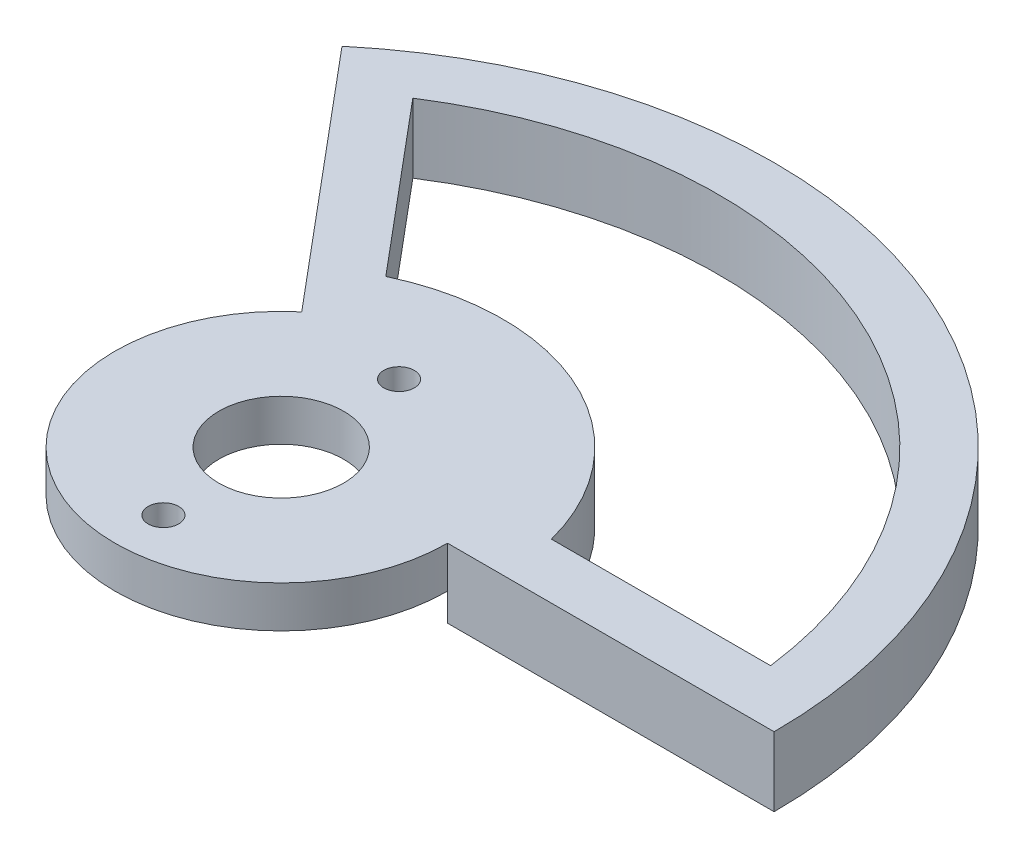
ISO-10303-21;
HEADER;
FILE_DESCRIPTION(('STEP AP214'),'2;1');
FILE_NAME('part.step','',(''),(''),'','','');
FILE_SCHEMA(('AUTOMOTIVE_DESIGN { 1 0 10303 214 1 1 1 1 }'));
ENDSEC;
DATA;
#1=APPLICATION_CONTEXT('core data for automotive mechanical design processes');
#2=APPLICATION_PROTOCOL_DEFINITION('international standard','automotive_design',2000,#1);
#3=PRODUCT_CONTEXT('',#1,'mechanical');
#4=PRODUCT('Part','Part','',(#3));
#5=PRODUCT_RELATED_PRODUCT_CATEGORY('part','',(#4));
#6=PRODUCT_DEFINITION_FORMATION('','',#4);
#7=PRODUCT_DEFINITION_CONTEXT('part definition',#1,'design');
#8=PRODUCT_DEFINITION('design','',#6,#7);
#9=PRODUCT_DEFINITION_SHAPE('','',#8);
#10=(LENGTH_UNIT() NAMED_UNIT(*) SI_UNIT(.MILLI.,.METRE.));
#11=(NAMED_UNIT(*) PLANE_ANGLE_UNIT() SI_UNIT($,.RADIAN.));
#12=(NAMED_UNIT(*) SI_UNIT($,.STERADIAN.) SOLID_ANGLE_UNIT());
#13=UNCERTAINTY_MEASURE_WITH_UNIT(LENGTH_MEASURE(1.E-05),#10,'distance_accuracy_value','');
#14=(GEOMETRIC_REPRESENTATION_CONTEXT(3) GLOBAL_UNCERTAINTY_ASSIGNED_CONTEXT((#13)) GLOBAL_UNIT_ASSIGNED_CONTEXT((#10,
#11,#12)) REPRESENTATION_CONTEXT('',''));
#15=CARTESIAN_POINT('',(0.,0.,0.));
#16=DIRECTION('',(0.,0.,1.));
#17=DIRECTION('',(1.,0.,0.));
#18=AXIS2_PLACEMENT_3D('',#15,#16,#17);
#19=CARTESIAN_POINT('',(0.,3.,0.));
#20=DIRECTION('',(0.,1.,0.));
#21=DIRECTION('',(0.,0.,1.));
#22=AXIS2_PLACEMENT_3D('',#19,#20,#21);
#23=PLANE('',#22);
#24=CARTESIAN_POINT('',(0.,3.,0.));
#25=DIRECTION('',(0.,-1.,0.));
#26=DIRECTION('',(0.,0.,-1.));
#27=AXIS2_PLACEMENT_3D('',#24,#25,#26);
#28=CIRCLE('',#27,31.56);
#29=CARTESIAN_POINT('',(-17.0586022455489,3.,-26.5525458182102));
#30=VERTEX_POINT('',#29);
#31=CARTESIAN_POINT('',(31.3054883367118,3.,-4.));
#32=VERTEX_POINT('',#31);
#33=EDGE_CURVE('E106',#30,#32,#28,.T.);
#34=ORIENTED_EDGE('',*,*,#33,.T.);
#35=DIRECTION('',(-1.,0.,0.));
#36=VECTOR('',#35,1.);
#37=CARTESIAN_POINT('',(31.3054883367118,3.,-4.));
#38=LINE('',#37,#36);
#39=CARTESIAN_POINT('',(15.4919333848297,3.,-4.));
#40=VERTEX_POINT('',#39);
#41=EDGE_CURVE('E115',#32,#40,#38,.T.);
#42=ORIENTED_EDGE('',*,*,#41,.T.);
#43=CARTESIAN_POINT('',(0.,3.,0.));
#44=DIRECTION('',(0.,1.,0.));
#45=DIRECTION('',(0.,0.,-1.));
#46=AXIS2_PLACEMENT_3D('',#43,#44,#45);
#47=CIRCLE('',#46,16.);
#48=CARTESIAN_POINT('',(-6.89384505738183,3.,-14.4386599213643));
#49=VERTEX_POINT('',#48);
#50=EDGE_CURVE('E48',#40,#49,#47,.T.);
#51=ORIENTED_EDGE('',*,*,#50,.T.);
#52=DIRECTION('',(-0.642787609686538,0.,-0.766044443118979));
#53=VECTOR('',#52,1.);
#54=CARTESIAN_POINT('',(-6.89384505738183,3.,-14.4386599213643));
#55=LINE('',#54,#53);
#56=EDGE_CURVE('E112',#49,#30,#55,.T.);
#57=ORIENTED_EDGE('',*,*,#56,.T.);
#58=EDGE_LOOP('',(#34,#42,#51,#57));
#59=FACE_BOUND('',#58,.T.);
#60=CARTESIAN_POINT('',(0.,3.,-8.5));
#61=DIRECTION('',(0.,1.,0.));
#62=DIRECTION('',(0.,0.,1.));
#63=AXIS2_PLACEMENT_3D('',#60,#61,#62);
#64=CIRCLE('',#63,1.1);
#65=CARTESIAN_POINT('',(0.,3.,-7.4));
#66=VERTEX_POINT('',#65);
#67=EDGE_CURVE('E176',#66,#66,#64,.T.);
#68=ORIENTED_EDGE('',*,*,#67,.F.);
#69=EDGE_LOOP('',(#68));
#70=FACE_BOUND('',#69,.T.);
#71=CARTESIAN_POINT('',(0.,3.,0.));
#72=DIRECTION('',(0.,1.,0.));
#73=DIRECTION('',(0.,0.,1.));
#74=AXIS2_PLACEMENT_3D('',#71,#72,#73);
#75=CIRCLE('',#74,12.);
#76=CARTESIAN_POINT('',(-7.71345131623846,3.,-9.19253331742775));
#77=VERTEX_POINT('',#76);
#78=CARTESIAN_POINT('',(12.,3.,0.));
#79=VERTEX_POINT('',#78);
#80=EDGE_CURVE('E188',#77,#79,#75,.T.);
#81=ORIENTED_EDGE('',*,*,#80,.T.);
#82=DIRECTION('',(1.,0.,0.));
#83=VECTOR('',#82,1.);
#84=CARTESIAN_POINT('',(12.,3.,0.));
#85=LINE('',#84,#83);
#86=CARTESIAN_POINT('',(35.56,3.,0.));
#87=VERTEX_POINT('',#86);
#88=EDGE_CURVE('E144',#79,#87,#85,.T.);
#89=ORIENTED_EDGE('',*,*,#88,.T.);
#90=CARTESIAN_POINT('',(0.,3.,0.));
#91=DIRECTION('',(0.,1.,0.));
#92=DIRECTION('',(0.,0.,1.));
#93=AXIS2_PLACEMENT_3D('',#90,#91,#92);
#94=CIRCLE('',#93,35.56);
#95=CARTESIAN_POINT('',(-22.8575274004533,3.,-27.2405403973109));
#96=VERTEX_POINT('',#95);
#97=EDGE_CURVE('E136',#87,#96,#94,.T.);
#98=ORIENTED_EDGE('',*,*,#97,.T.);
#99=DIRECTION('',(0.642787609686538,0.,0.766044443118979));
#100=VECTOR('',#99,1.);
#101=CARTESIAN_POINT('',(-22.8575274004533,3.,-27.2405403973109));
#102=LINE('',#101,#100);
#103=EDGE_CURVE('E156',#96,#77,#102,.T.);
#104=ORIENTED_EDGE('',*,*,#103,.T.);
#105=EDGE_LOOP('',(#81,#89,#98,#104));
#106=FACE_BOUND('',#105,.T.);
#107=CARTESIAN_POINT('',(0.,3.,0.));
#108=DIRECTION('',(0.,1.,0.));
#109=DIRECTION('',(0.,0.,1.));
#110=AXIS2_PLACEMENT_3D('',#107,#108,#109);
#111=CIRCLE('',#110,4.5);
#112=CARTESIAN_POINT('',(0.,3.,4.5));
#113=VERTEX_POINT('',#112);
#114=EDGE_CURVE('E182',#113,#113,#111,.T.);
#115=ORIENTED_EDGE('',*,*,#114,.F.);
#116=EDGE_LOOP('',(#115));
#117=FACE_BOUND('',#116,.T.);
#118=CARTESIAN_POINT('',(0.,3.,8.5));
#119=DIRECTION('',(0.,1.,0.));
#120=DIRECTION('',(0.,0.,1.));
#121=AXIS2_PLACEMENT_3D('',#118,#119,#120);
#122=CIRCLE('',#121,1.1);
#123=CARTESIAN_POINT('',(0.,3.,9.6));
#124=VERTEX_POINT('',#123);
#125=EDGE_CURVE('E170',#124,#124,#122,.T.);
#126=ORIENTED_EDGE('',*,*,#125,.F.);
#127=EDGE_LOOP('',(#126));
#128=FACE_BOUND('',#127,.T.);
#129=ADVANCED_FACE('F33',(#59,#70,#106,#117,#128),#23,.T.);
#130=CARTESIAN_POINT('',(0.,0.,0.));
#131=DIRECTION('',(0.,1.,0.));
#132=DIRECTION('',(0.,0.,1.));
#133=AXIS2_PLACEMENT_3D('',#130,#131,#132);
#134=PLANE('',#133);
#135=CARTESIAN_POINT('',(0.,0.,0.));
#136=DIRECTION('',(0.,1.,0.));
#137=DIRECTION('',(0.,0.,1.));
#138=AXIS2_PLACEMENT_3D('',#135,#136,#137);
#139=CIRCLE('',#138,12.);
#140=CARTESIAN_POINT('',(12.,0.,0.));
#141=VERTEX_POINT('',#140);
#142=CARTESIAN_POINT('',(-7.71345131623846,0.,-9.19253331742775));
#143=VERTEX_POINT('',#142);
#144=EDGE_CURVE('E191',#141,#143,#139,.T.);
#145=ORIENTED_EDGE('',*,*,#144,.F.);
#146=EDGE_CURVE('E185',#143,#141,#139,.T.);
#147=ORIENTED_EDGE('',*,*,#146,.F.);
#148=EDGE_LOOP('',(#145,#147));
#149=FACE_BOUND('',#148,.T.);
#150=CARTESIAN_POINT('',(0.,0.,0.));
#151=DIRECTION('',(0.,1.,0.));
#152=DIRECTION('',(0.,0.,1.));
#153=AXIS2_PLACEMENT_3D('',#150,#151,#152);
#154=CIRCLE('',#153,4.5);
#155=CARTESIAN_POINT('',(0.,0.,4.5));
#156=VERTEX_POINT('',#155);
#157=EDGE_CURVE('E179',#156,#156,#154,.T.);
#158=ORIENTED_EDGE('',*,*,#157,.T.);
#159=EDGE_LOOP('',(#158));
#160=FACE_BOUND('',#159,.T.);
#161=CARTESIAN_POINT('',(0.,0.,-8.5));
#162=DIRECTION('',(0.,1.,0.));
#163=DIRECTION('',(0.,0.,1.));
#164=AXIS2_PLACEMENT_3D('',#161,#162,#163);
#165=CIRCLE('',#164,1.1);
#166=CARTESIAN_POINT('',(0.,0.,-7.4));
#167=VERTEX_POINT('',#166);
#168=EDGE_CURVE('E173',#167,#167,#165,.T.);
#169=ORIENTED_EDGE('',*,*,#168,.T.);
#170=EDGE_LOOP('',(#169));
#171=FACE_BOUND('',#170,.T.);
#172=CARTESIAN_POINT('',(0.,0.,8.5));
#173=DIRECTION('',(0.,1.,0.));
#174=DIRECTION('',(0.,0.,1.));
#175=AXIS2_PLACEMENT_3D('',#172,#173,#174);
#176=CIRCLE('',#175,1.1);
#177=CARTESIAN_POINT('',(0.,0.,9.6));
#178=VERTEX_POINT('',#177);
#179=EDGE_CURVE('E162',#178,#178,#176,.T.);
#180=ORIENTED_EDGE('',*,*,#179,.T.);
#181=EDGE_LOOP('',(#180));
#182=FACE_BOUND('',#181,.T.);
#183=ADVANCED_FACE('F202',(#149,#160,#171,#182),#134,.F.);
#184=CARTESIAN_POINT('',(0.,3.,0.));
#185=DIRECTION('',(0.,-1.,0.));
#186=DIRECTION('',(0.,0.,-1.));
#187=AXIS2_PLACEMENT_3D('',#184,#185,#186);
#188=CYLINDRICAL_SURFACE('',#187,12.);
#189=ORIENTED_EDGE('',*,*,#146,.T.);
#190=DIRECTION('',(0.,-1.,0.));
#191=VECTOR('',#190,1.);
#192=CARTESIAN_POINT('',(12.,3.,0.));
#193=LINE('',#192,#191);
#194=EDGE_CURVE('E11',#141,#79,#193,.F.);
#195=ORIENTED_EDGE('',*,*,#194,.T.);
#196=ORIENTED_EDGE('',*,*,#80,.F.);
#197=DIRECTION('',(0.,-1.,0.));
#198=VECTOR('',#197,1.);
#199=CARTESIAN_POINT('',(-7.71345131623846,3.,-9.19253331742775));
#200=LINE('',#199,#198);
#201=EDGE_CURVE('E41',#77,#143,#200,.T.);
#202=ORIENTED_EDGE('',*,*,#201,.T.);
#203=EDGE_LOOP('',(#189,#195,#196,#202));
#204=FACE_BOUND('',#203,.T.);
#205=ADVANCED_FACE('F35',(#204),#188,.T.);
#206=CARTESIAN_POINT('',(0.,3.,0.));
#207=DIRECTION('',(0.,-1.,0.));
#208=DIRECTION('',(0.,0.,-1.));
#209=AXIS2_PLACEMENT_3D('',#206,#207,#208);
#210=CYLINDRICAL_SURFACE('',#209,4.5);
#211=ORIENTED_EDGE('',*,*,#114,.T.);
#212=EDGE_LOOP('',(#211));
#213=FACE_BOUND('',#212,.T.);
#214=ORIENTED_EDGE('',*,*,#157,.F.);
#215=EDGE_LOOP('',(#214));
#216=FACE_BOUND('',#215,.T.);
#217=ADVANCED_FACE('F237',(#213,#216),#210,.F.);
#218=CARTESIAN_POINT('',(0.,3.,-8.5));
#219=DIRECTION('',(0.,-1.,0.));
#220=DIRECTION('',(0.,0.,-1.));
#221=AXIS2_PLACEMENT_3D('',#218,#219,#220);
#222=CYLINDRICAL_SURFACE('',#221,1.1);
#223=ORIENTED_EDGE('',*,*,#67,.T.);
#224=EDGE_LOOP('',(#223));
#225=FACE_BOUND('',#224,.T.);
#226=ORIENTED_EDGE('',*,*,#168,.F.);
#227=EDGE_LOOP('',(#226));
#228=FACE_BOUND('',#227,.T.);
#229=ADVANCED_FACE('F229',(#225,#228),#222,.F.);
#230=CARTESIAN_POINT('',(0.,3.,8.5));
#231=DIRECTION('',(0.,-1.,0.));
#232=DIRECTION('',(0.,0.,-1.));
#233=AXIS2_PLACEMENT_3D('',#230,#231,#232);
#234=CYLINDRICAL_SURFACE('',#233,1.1);
#235=ORIENTED_EDGE('',*,*,#125,.T.);
#236=EDGE_LOOP('',(#235));
#237=FACE_BOUND('',#236,.T.);
#238=ORIENTED_EDGE('',*,*,#179,.F.);
#239=EDGE_LOOP('',(#238));
#240=FACE_BOUND('',#239,.T.);
#241=ADVANCED_FACE('F226',(#237,#240),#234,.F.);
#242=CARTESIAN_POINT('',(0.,-2.,0.));
#243=DIRECTION('',(0.,1.,0.));
#244=DIRECTION('',(0.,0.,1.));
#245=AXIS2_PLACEMENT_3D('',#242,#243,#244);
#246=CYLINDRICAL_SURFACE('',#245,12.);
#247=ORIENTED_EDGE('',*,*,#144,.T.);
#248=DIRECTION('',(0.,1.,0.));
#249=VECTOR('',#248,1.);
#250=CARTESIAN_POINT('',(-7.71345131623846,-2.,-9.19253331742775));
#251=LINE('',#250,#249);
#252=CARTESIAN_POINT('',(-7.71345131623846,-2.,-9.19253331742775));
#253=VERTEX_POINT('',#252);
#254=EDGE_CURVE('E166',#253,#143,#251,.T.);
#255=ORIENTED_EDGE('',*,*,#254,.F.);
#256=CARTESIAN_POINT('',(0.,-2.,0.));
#257=DIRECTION('',(0.,-1.,0.));
#258=DIRECTION('',(0.,0.,1.));
#259=AXIS2_PLACEMENT_3D('',#256,#257,#258);
#260=CIRCLE('',#259,12.);
#261=CARTESIAN_POINT('',(12.,-2.,0.));
#262=VERTEX_POINT('',#261);
#263=EDGE_CURVE('E147',#253,#262,#260,.T.);
#264=ORIENTED_EDGE('',*,*,#263,.T.);
#265=DIRECTION('',(0.,1.,0.));
#266=VECTOR('',#265,1.);
#267=CARTESIAN_POINT('',(12.,-2.,0.));
#268=LINE('',#267,#266);
#269=EDGE_CURVE('E163',#262,#141,#268,.T.);
#270=ORIENTED_EDGE('',*,*,#269,.T.);
#271=EDGE_LOOP('',(#247,#255,#264,#270));
#272=FACE_BOUND('',#271,.T.);
#273=ADVANCED_FACE('F205',(#272),#246,.F.);
#274=CARTESIAN_POINT('',(0.,-2.,0.));
#275=DIRECTION('',(0.,1.,0.));
#276=DIRECTION('',(0.,0.,1.));
#277=AXIS2_PLACEMENT_3D('',#274,#275,#276);
#278=CYLINDRICAL_SURFACE('',#277,35.56);
#279=ORIENTED_EDGE('',*,*,#97,.F.);
#280=DIRECTION('',(0.,1.,0.));
#281=VECTOR('',#280,1.);
#282=CARTESIAN_POINT('',(35.56,-2.,0.));
#283=LINE('',#282,#281);
#284=CARTESIAN_POINT('',(35.56,-2.,0.));
#285=VERTEX_POINT('',#284);
#286=EDGE_CURVE('E160',#285,#87,#283,.T.);
#287=ORIENTED_EDGE('',*,*,#286,.F.);
#288=CARTESIAN_POINT('',(0.,-2.,0.));
#289=DIRECTION('',(0.,1.,0.));
#290=DIRECTION('',(0.,0.,1.));
#291=AXIS2_PLACEMENT_3D('',#288,#289,#290);
#292=CIRCLE('',#291,35.56);
#293=CARTESIAN_POINT('',(-22.8575274004533,-2.,-27.2405403973109));
#294=VERTEX_POINT('',#293);
#295=EDGE_CURVE('E140',#285,#294,#292,.T.);
#296=ORIENTED_EDGE('',*,*,#295,.T.);
#297=DIRECTION('',(0.,1.,0.));
#298=VECTOR('',#297,1.);
#299=CARTESIAN_POINT('',(-22.8575274004533,-2.,-27.2405403973109));
#300=LINE('',#299,#298);
#301=EDGE_CURVE('E153',#294,#96,#300,.T.);
#302=ORIENTED_EDGE('',*,*,#301,.T.);
#303=EDGE_LOOP('',(#279,#287,#296,#302));
#304=FACE_BOUND('',#303,.T.);
#305=ADVANCED_FACE('F215',(#304),#278,.T.);
#306=CARTESIAN_POINT('',(12.,-2.,0.));
#307=DIRECTION('',(0.,0.,1.));
#308=DIRECTION('',(1.,0.,0.));
#309=AXIS2_PLACEMENT_3D('',#306,#307,#308);
#310=PLANE('',#309);
#311=ORIENTED_EDGE('',*,*,#88,.F.);
#312=ORIENTED_EDGE('',*,*,#194,.F.);
#313=ORIENTED_EDGE('',*,*,#269,.F.);
#314=DIRECTION('',(1.,0.,0.));
#315=VECTOR('',#314,1.);
#316=CARTESIAN_POINT('',(12.,-2.,0.));
#317=LINE('',#316,#315);
#318=EDGE_CURVE('E150',#262,#285,#317,.T.);
#319=ORIENTED_EDGE('',*,*,#318,.T.);
#320=ORIENTED_EDGE('',*,*,#286,.T.);
#321=EDGE_LOOP('',(#311,#312,#313,#319,#320));
#322=FACE_BOUND('',#321,.T.);
#323=ADVANCED_FACE('F217',(#322),#310,.T.);
#324=CARTESIAN_POINT('',(-22.8575274004533,-2.,-27.2405403973109));
#325=DIRECTION('',(-0.766044443118979,0.,0.642787609686538));
#326=DIRECTION('',(0.642787609686538,0.,0.766044443118979));
#327=AXIS2_PLACEMENT_3D('',#324,#325,#326);
#328=PLANE('',#327);
#329=ORIENTED_EDGE('',*,*,#103,.F.);
#330=ORIENTED_EDGE('',*,*,#301,.F.);
#331=DIRECTION('',(0.642787609686538,0.,0.766044443118979));
#332=VECTOR('',#331,1.);
#333=CARTESIAN_POINT('',(-22.8575274004533,-2.,-27.2405403973109));
#334=LINE('',#333,#332);
#335=EDGE_CURVE('E143',#294,#253,#334,.T.);
#336=ORIENTED_EDGE('',*,*,#335,.T.);
#337=ORIENTED_EDGE('',*,*,#254,.T.);
#338=ORIENTED_EDGE('',*,*,#201,.F.);
#339=EDGE_LOOP('',(#329,#330,#336,#337,#338));
#340=FACE_BOUND('',#339,.T.);
#341=ADVANCED_FACE('F207',(#340),#328,.T.);
#342=CARTESIAN_POINT('',(0.,-2.,0.));
#343=DIRECTION('',(0.,1.,0.));
#344=DIRECTION('',(0.,0.,1.));
#345=AXIS2_PLACEMENT_3D('',#342,#343,#344);
#346=PLANE('',#345);
#347=DIRECTION('',(-1.,0.,0.));
#348=VECTOR('',#347,1.);
#349=CARTESIAN_POINT('',(31.3054883367118,-2.,-4.));
#350=LINE('',#349,#348);
#351=CARTESIAN_POINT('',(31.3054883367118,-2.,-4.));
#352=VERTEX_POINT('',#351);
#353=CARTESIAN_POINT('',(15.4919333848297,-2.,-4.));
#354=VERTEX_POINT('',#353);
#355=EDGE_CURVE('E130',#352,#354,#350,.T.);
#356=ORIENTED_EDGE('',*,*,#355,.F.);
#357=CARTESIAN_POINT('',(0.,-2.,0.));
#358=DIRECTION('',(0.,-1.,0.));
#359=DIRECTION('',(0.,0.,-1.));
#360=AXIS2_PLACEMENT_3D('',#357,#358,#359);
#361=CIRCLE('',#360,31.56);
#362=CARTESIAN_POINT('',(-17.0586022455489,-2.,-26.5525458182102));
#363=VERTEX_POINT('',#362);
#364=EDGE_CURVE('E56',#363,#352,#361,.T.);
#365=ORIENTED_EDGE('',*,*,#364,.F.);
#366=DIRECTION('',(-0.642787609686538,0.,-0.766044443118979));
#367=VECTOR('',#366,1.);
#368=CARTESIAN_POINT('',(-6.89384505738183,-2.,-14.4386599213643));
#369=LINE('',#368,#367);
#370=CARTESIAN_POINT('',(-6.89384505738183,-2.,-14.4386599213643));
#371=VERTEX_POINT('',#370);
#372=EDGE_CURVE('E121',#371,#363,#369,.T.);
#373=ORIENTED_EDGE('',*,*,#372,.F.);
#374=CARTESIAN_POINT('',(0.,-2.,0.));
#375=DIRECTION('',(0.,1.,0.));
#376=DIRECTION('',(0.,0.,-1.));
#377=AXIS2_PLACEMENT_3D('',#374,#375,#376);
#378=CIRCLE('',#377,16.);
#379=EDGE_CURVE('E124',#354,#371,#378,.T.);
#380=ORIENTED_EDGE('',*,*,#379,.F.);
#381=EDGE_LOOP('',(#356,#365,#373,#380));
#382=FACE_BOUND('',#381,.T.);
#383=ORIENTED_EDGE('',*,*,#295,.F.);
#384=ORIENTED_EDGE('',*,*,#318,.F.);
#385=ORIENTED_EDGE('',*,*,#263,.F.);
#386=ORIENTED_EDGE('',*,*,#335,.F.);
#387=EDGE_LOOP('',(#383,#384,#385,#386));
#388=FACE_BOUND('',#387,.T.);
#389=ADVANCED_FACE('F211',(#382,#388),#346,.F.);
#390=CARTESIAN_POINT('',(0.,3.,0.));
#391=DIRECTION('',(0.,-1.,0.));
#392=DIRECTION('',(0.,0.,-1.));
#393=AXIS2_PLACEMENT_3D('',#390,#391,#392);
#394=CYLINDRICAL_SURFACE('',#393,31.56);
#395=ORIENTED_EDGE('',*,*,#364,.T.);
#396=DIRECTION('',(0.,-1.,0.));
#397=VECTOR('',#396,1.);
#398=CARTESIAN_POINT('',(31.3054883367118,3.,-4.));
#399=LINE('',#398,#397);
#400=EDGE_CURVE('E102',#32,#352,#399,.T.);
#401=ORIENTED_EDGE('',*,*,#400,.F.);
#402=ORIENTED_EDGE('',*,*,#33,.F.);
#403=DIRECTION('',(0.,-1.,0.));
#404=VECTOR('',#403,1.);
#405=CARTESIAN_POINT('',(-17.0586022455489,3.,-26.5525458182102));
#406=LINE('',#405,#404);
#407=EDGE_CURVE('E134',#30,#363,#406,.T.);
#408=ORIENTED_EDGE('',*,*,#407,.T.);
#409=EDGE_LOOP('',(#395,#401,#402,#408));
#410=FACE_BOUND('',#409,.T.);
#411=ADVANCED_FACE('F104',(#410),#394,.F.);
#412=CARTESIAN_POINT('',(-6.89384505738183,3.,-14.4386599213643));
#413=DIRECTION('',(-0.766044443118979,0.,0.642787609686538));
#414=DIRECTION('',(0.642787609686538,0.,0.766044443118979));
#415=AXIS2_PLACEMENT_3D('',#412,#413,#414);
#416=PLANE('',#415);
#417=ORIENTED_EDGE('',*,*,#372,.T.);
#418=ORIENTED_EDGE('',*,*,#407,.F.);
#419=ORIENTED_EDGE('',*,*,#56,.F.);
#420=DIRECTION('',(0.,-1.,0.));
#421=VECTOR('',#420,1.);
#422=CARTESIAN_POINT('',(-6.89384505738183,3.,-14.4386599213643));
#423=LINE('',#422,#421);
#424=EDGE_CURVE('E137',#49,#371,#423,.T.);
#425=ORIENTED_EDGE('',*,*,#424,.T.);
#426=EDGE_LOOP('',(#417,#418,#419,#425));
#427=FACE_BOUND('',#426,.T.);
#428=ADVANCED_FACE('F258',(#427),#416,.F.);
#429=CARTESIAN_POINT('',(0.,3.,0.));
#430=DIRECTION('',(0.,-1.,0.));
#431=DIRECTION('',(0.,0.,-1.));
#432=AXIS2_PLACEMENT_3D('',#429,#430,#431);
#433=CYLINDRICAL_SURFACE('',#432,16.);
#434=ORIENTED_EDGE('',*,*,#379,.T.);
#435=ORIENTED_EDGE('',*,*,#424,.F.);
#436=ORIENTED_EDGE('',*,*,#50,.F.);
#437=DIRECTION('',(0.,-1.,0.));
#438=VECTOR('',#437,1.);
#439=CARTESIAN_POINT('',(15.4919333848297,3.,-4.));
#440=LINE('',#439,#438);
#441=EDGE_CURVE('E111',#40,#354,#440,.T.);
#442=ORIENTED_EDGE('',*,*,#441,.T.);
#443=EDGE_LOOP('',(#434,#435,#436,#442));
#444=FACE_BOUND('',#443,.T.);
#445=ADVANCED_FACE('F261',(#444),#433,.T.);
#446=CARTESIAN_POINT('',(31.3054883367118,3.,-4.));
#447=DIRECTION('',(0.,0.,1.));
#448=DIRECTION('',(1.,0.,0.));
#449=AXIS2_PLACEMENT_3D('',#446,#447,#448);
#450=PLANE('',#449);
#451=ORIENTED_EDGE('',*,*,#355,.T.);
#452=ORIENTED_EDGE('',*,*,#441,.F.);
#453=ORIENTED_EDGE('',*,*,#41,.F.);
#454=ORIENTED_EDGE('',*,*,#400,.T.);
#455=EDGE_LOOP('',(#451,#452,#453,#454));
#456=FACE_BOUND('',#455,.T.);
#457=ADVANCED_FACE('F116',(#456),#450,.F.);
#458=CLOSED_SHELL('',(#129,#183,#205,#217,#229,#241,#273,#305,#323,#341,#389,#411,#428,#445,#457));
#459=MANIFOLD_SOLID_BREP('B2',#458);
#460=ADVANCED_BREP_SHAPE_REPRESENTATION('',(#18,#459),#14);
#461=SHAPE_DEFINITION_REPRESENTATION(#9,#460);
ENDSEC;
END-ISO-10303-21;
